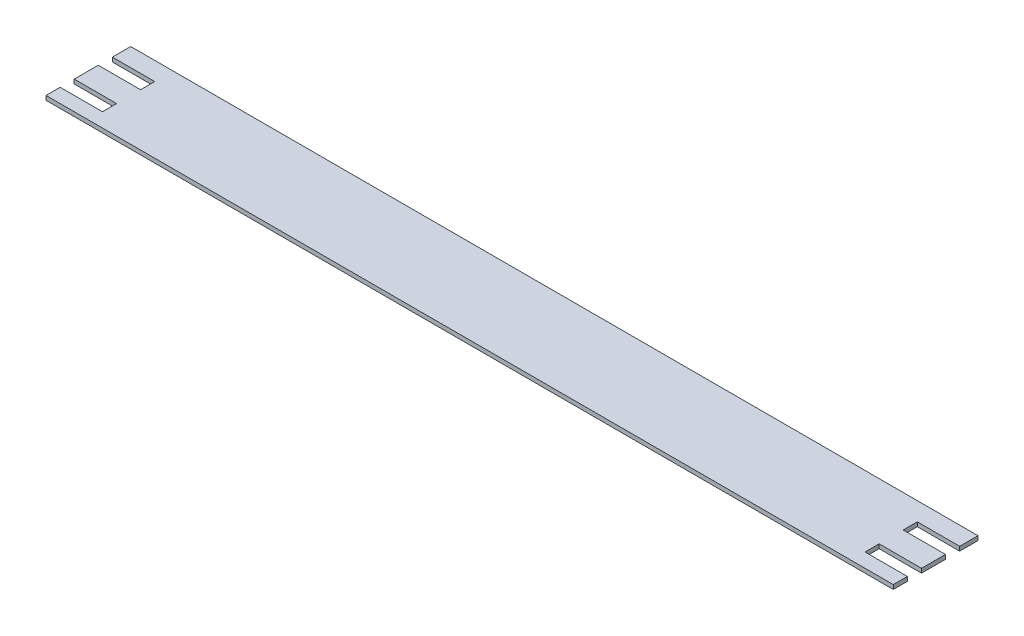
ISO-10303-21;
HEADER;
FILE_DESCRIPTION(('STEP AP214'),'2;1');
FILE_NAME('part.step','',(''),(''),'','','');
FILE_SCHEMA(('AUTOMOTIVE_DESIGN { 1 0 10303 214 1 1 1 1 }'));
ENDSEC;
DATA;
#1=APPLICATION_CONTEXT('core data for automotive mechanical design processes');
#2=APPLICATION_PROTOCOL_DEFINITION('international standard','automotive_design',2000,#1);
#3=PRODUCT_CONTEXT('',#1,'mechanical');
#4=PRODUCT('Part','Part','',(#3));
#5=PRODUCT_RELATED_PRODUCT_CATEGORY('part','',(#4));
#6=PRODUCT_DEFINITION_FORMATION('','',#4);
#7=PRODUCT_DEFINITION_CONTEXT('part definition',#1,'design');
#8=PRODUCT_DEFINITION('design','',#6,#7);
#9=PRODUCT_DEFINITION_SHAPE('','',#8);
#10=(LENGTH_UNIT() NAMED_UNIT(*) SI_UNIT(.MILLI.,.METRE.));
#11=(NAMED_UNIT(*) PLANE_ANGLE_UNIT() SI_UNIT($,.RADIAN.));
#12=(NAMED_UNIT(*) SI_UNIT($,.STERADIAN.) SOLID_ANGLE_UNIT());
#13=UNCERTAINTY_MEASURE_WITH_UNIT(LENGTH_MEASURE(1.E-05),#10,'distance_accuracy_value','');
#14=(GEOMETRIC_REPRESENTATION_CONTEXT(3) GLOBAL_UNCERTAINTY_ASSIGNED_CONTEXT((#13)) GLOBAL_UNIT_ASSIGNED_CONTEXT((#10,
#11,#12)) REPRESENTATION_CONTEXT('',''));
#15=CARTESIAN_POINT('',(0.,0.,0.));
#16=DIRECTION('',(0.,0.,1.));
#17=DIRECTION('',(1.,0.,0.));
#18=AXIS2_PLACEMENT_3D('',#15,#16,#17);
#19=CARTESIAN_POINT('',(300.,-50.01,13.));
#20=DIRECTION('',(0.,0.,-1.));
#21=DIRECTION('',(-1.,0.,0.));
#22=AXIS2_PLACEMENT_3D('',#19,#20,#21);
#23=PLANE('',#22);
#24=DIRECTION('',(0.,-1.,0.));
#25=VECTOR('',#24,1.);
#26=CARTESIAN_POINT('',(300.,1.71683972880179E-13,13.));
#27=LINE('',#26,#25);
#28=CARTESIAN_POINT('',(300.,-47.,13.));
#29=VERTEX_POINT('',#28);
#30=CARTESIAN_POINT('',(300.,-50.,13.));
#31=VERTEX_POINT('',#30);
#32=EDGE_CURVE('E231',#29,#31,#27,.T.);
#33=ORIENTED_EDGE('',*,*,#32,.F.);
#34=DIRECTION('',(1.,0.,0.));
#35=VECTOR('',#34,1.);
#36=CARTESIAN_POINT('',(-300.,-47.,13.));
#37=LINE('',#36,#35);
#38=CARTESIAN_POINT('',(270.,-47.,13.));
#39=VERTEX_POINT('',#38);
#40=EDGE_CURVE('E240',#39,#29,#37,.T.);
#41=ORIENTED_EDGE('',*,*,#40,.F.);
#42=DIRECTION('',(0.,1.,0.));
#43=VECTOR('',#42,1.);
#44=CARTESIAN_POINT('',(270.,-50.01,13.));
#45=LINE('',#44,#43);
#46=CARTESIAN_POINT('',(270.,-50.,13.));
#47=VERTEX_POINT('',#46);
#48=EDGE_CURVE('E303',#47,#39,#45,.T.);
#49=ORIENTED_EDGE('',*,*,#48,.F.);
#50=DIRECTION('',(-1.,0.,0.));
#51=VECTOR('',#50,1.);
#52=CARTESIAN_POINT('',(-300.,-50.,13.));
#53=LINE('',#52,#51);
#54=EDGE_CURVE('E268',#31,#47,#53,.T.);
#55=ORIENTED_EDGE('',*,*,#54,.F.);
#56=EDGE_LOOP('',(#33,#41,#49,#55));
#57=FACE_BOUND('',#56,.T.);
#58=ADVANCED_FACE('F35',(#57),#23,.F.);
#59=CARTESIAN_POINT('',(300.,-50.01,23.));
#60=DIRECTION('',(0.,0.,1.));
#61=DIRECTION('',(1.,0.,0.));
#62=AXIS2_PLACEMENT_3D('',#59,#60,#61);
#63=PLANE('',#62);
#64=DIRECTION('',(0.,1.,0.));
#65=VECTOR('',#64,1.);
#66=CARTESIAN_POINT('',(270.,-50.01,23.));
#67=LINE('',#66,#65);
#68=CARTESIAN_POINT('',(270.,-50.,23.));
#69=VERTEX_POINT('',#68);
#70=CARTESIAN_POINT('',(270.,-47.,23.));
#71=VERTEX_POINT('',#70);
#72=EDGE_CURVE('E39',#69,#71,#67,.T.);
#73=ORIENTED_EDGE('',*,*,#72,.T.);
#74=DIRECTION('',(-1.,0.,0.));
#75=VECTOR('',#74,1.);
#76=CARTESIAN_POINT('',(-300.,-47.,23.));
#77=LINE('',#76,#75);
#78=CARTESIAN_POINT('',(300.,-47.,23.));
#79=VERTEX_POINT('',#78);
#80=EDGE_CURVE('E280',#79,#71,#77,.T.);
#81=ORIENTED_EDGE('',*,*,#80,.F.);
#82=DIRECTION('',(0.,1.,0.));
#83=VECTOR('',#82,1.);
#84=CARTESIAN_POINT('',(300.,1.71683972880179E-13,23.));
#85=LINE('',#84,#83);
#86=CARTESIAN_POINT('',(300.,-50.,23.));
#87=VERTEX_POINT('',#86);
#88=EDGE_CURVE('E228',#87,#79,#85,.T.);
#89=ORIENTED_EDGE('',*,*,#88,.F.);
#90=DIRECTION('',(1.,0.,0.));
#91=VECTOR('',#90,1.);
#92=CARTESIAN_POINT('',(-300.,-50.,23.));
#93=LINE('',#92,#91);
#94=EDGE_CURVE('E272',#69,#87,#93,.T.);
#95=ORIENTED_EDGE('',*,*,#94,.F.);
#96=EDGE_LOOP('',(#73,#81,#89,#95));
#97=FACE_BOUND('',#96,.T.);
#98=ADVANCED_FACE('F316',(#97),#63,.F.);
#99=CARTESIAN_POINT('',(270.,-50.01,13.));
#100=DIRECTION('',(-1.,0.,0.));
#101=DIRECTION('',(0.,0.,1.));
#102=AXIS2_PLACEMENT_3D('',#99,#100,#101);
#103=PLANE('',#102);
#104=ORIENTED_EDGE('',*,*,#48,.T.);
#105=DIRECTION('',(0.,0.,-1.));
#106=VECTOR('',#105,1.);
#107=CARTESIAN_POINT('',(270.,-47.,3.));
#108=LINE('',#107,#106);
#109=EDGE_CURVE('E320',#71,#39,#108,.T.);
#110=ORIENTED_EDGE('',*,*,#109,.F.);
#111=ORIENTED_EDGE('',*,*,#72,.F.);
#112=DIRECTION('',(0.,0.,1.));
#113=VECTOR('',#112,1.);
#114=CARTESIAN_POINT('',(270.,-50.,60.));
#115=LINE('',#114,#113);
#116=EDGE_CURVE('E345',#47,#69,#115,.T.);
#117=ORIENTED_EDGE('',*,*,#116,.F.);
#118=EDGE_LOOP('',(#104,#110,#111,#117));
#119=FACE_BOUND('',#118,.T.);
#120=ADVANCED_FACE('F321',(#119),#103,.F.);
#121=CARTESIAN_POINT('',(300.,-50.01,40.));
#122=DIRECTION('',(0.,0.,-1.));
#123=DIRECTION('',(-1.,0.,0.));
#124=AXIS2_PLACEMENT_3D('',#121,#122,#123);
#125=PLANE('',#124);
#126=DIRECTION('',(0.,-1.,0.));
#127=VECTOR('',#126,1.);
#128=CARTESIAN_POINT('',(300.,1.71683972880179E-13,40.));
#129=LINE('',#128,#127);
#130=CARTESIAN_POINT('',(300.,-47.,40.));
#131=VERTEX_POINT('',#130);
#132=CARTESIAN_POINT('',(300.,-50.,40.));
#133=VERTEX_POINT('',#132);
#134=EDGE_CURVE('E225',#131,#133,#129,.T.);
#135=ORIENTED_EDGE('',*,*,#134,.F.);
#136=DIRECTION('',(1.,0.,0.));
#137=VECTOR('',#136,1.);
#138=CARTESIAN_POINT('',(-300.,-47.,40.));
#139=LINE('',#138,#137);
#140=CARTESIAN_POINT('',(270.,-47.,40.));
#141=VERTEX_POINT('',#140);
#142=EDGE_CURVE('E235',#141,#131,#139,.T.);
#143=ORIENTED_EDGE('',*,*,#142,.F.);
#144=DIRECTION('',(0.,1.,0.));
#145=VECTOR('',#144,1.);
#146=CARTESIAN_POINT('',(270.,-50.01,40.));
#147=LINE('',#146,#145);
#148=CARTESIAN_POINT('',(270.,-50.,40.));
#149=VERTEX_POINT('',#148);
#150=EDGE_CURVE('E254',#149,#141,#147,.T.);
#151=ORIENTED_EDGE('',*,*,#150,.F.);
#152=DIRECTION('',(-1.,0.,0.));
#153=VECTOR('',#152,1.);
#154=CARTESIAN_POINT('',(-300.,-50.,40.));
#155=LINE('',#154,#153);
#156=EDGE_CURVE('E244',#133,#149,#155,.T.);
#157=ORIENTED_EDGE('',*,*,#156,.F.);
#158=EDGE_LOOP('',(#135,#143,#151,#157));
#159=FACE_BOUND('',#158,.T.);
#160=ADVANCED_FACE('F377',(#159),#125,.F.);
#161=CARTESIAN_POINT('',(300.,-50.01,50.));
#162=DIRECTION('',(0.,0.,1.));
#163=DIRECTION('',(1.,0.,0.));
#164=AXIS2_PLACEMENT_3D('',#161,#162,#163);
#165=PLANE('',#164);
#166=DIRECTION('',(0.,1.,0.));
#167=VECTOR('',#166,1.);
#168=CARTESIAN_POINT('',(270.,-50.01,50.));
#169=LINE('',#168,#167);
#170=CARTESIAN_POINT('',(270.,-50.,50.));
#171=VERTEX_POINT('',#170);
#172=CARTESIAN_POINT('',(270.,-47.,50.));
#173=VERTEX_POINT('',#172);
#174=EDGE_CURVE('E258',#171,#173,#169,.T.);
#175=ORIENTED_EDGE('',*,*,#174,.T.);
#176=DIRECTION('',(-1.,0.,0.));
#177=VECTOR('',#176,1.);
#178=CARTESIAN_POINT('',(-300.,-47.,50.));
#179=LINE('',#178,#177);
#180=CARTESIAN_POINT('',(300.,-47.,50.));
#181=VERTEX_POINT('',#180);
#182=EDGE_CURVE('E229',#181,#173,#179,.T.);
#183=ORIENTED_EDGE('',*,*,#182,.F.);
#184=DIRECTION('',(0.,1.,0.));
#185=VECTOR('',#184,1.);
#186=CARTESIAN_POINT('',(300.,1.71683972880179E-13,50.));
#187=LINE('',#186,#185);
#188=CARTESIAN_POINT('',(300.,-50.,50.));
#189=VERTEX_POINT('',#188);
#190=EDGE_CURVE('E223',#189,#181,#187,.T.);
#191=ORIENTED_EDGE('',*,*,#190,.F.);
#192=DIRECTION('',(1.,0.,0.));
#193=VECTOR('',#192,1.);
#194=CARTESIAN_POINT('',(-300.,-50.,50.));
#195=LINE('',#194,#193);
#196=EDGE_CURVE('E238',#171,#189,#195,.T.);
#197=ORIENTED_EDGE('',*,*,#196,.F.);
#198=EDGE_LOOP('',(#175,#183,#191,#197));
#199=FACE_BOUND('',#198,.T.);
#200=ADVANCED_FACE('F381',(#199),#165,.F.);
#201=CARTESIAN_POINT('',(270.,-50.01,40.));
#202=DIRECTION('',(-1.,0.,0.));
#203=DIRECTION('',(0.,0.,1.));
#204=AXIS2_PLACEMENT_3D('',#201,#202,#203);
#205=PLANE('',#204);
#206=ORIENTED_EDGE('',*,*,#150,.T.);
#207=DIRECTION('',(0.,0.,-1.));
#208=VECTOR('',#207,1.);
#209=CARTESIAN_POINT('',(270.,-47.,3.));
#210=LINE('',#209,#208);
#211=EDGE_CURVE('E232',#173,#141,#210,.T.);
#212=ORIENTED_EDGE('',*,*,#211,.F.);
#213=ORIENTED_EDGE('',*,*,#174,.F.);
#214=DIRECTION('',(0.,0.,1.));
#215=VECTOR('',#214,1.);
#216=CARTESIAN_POINT('',(270.,-50.,60.));
#217=LINE('',#216,#215);
#218=EDGE_CURVE('E241',#149,#171,#217,.T.);
#219=ORIENTED_EDGE('',*,*,#218,.F.);
#220=EDGE_LOOP('',(#206,#212,#213,#219));
#221=FACE_BOUND('',#220,.T.);
#222=ADVANCED_FACE('F387',(#221),#205,.F.);
#223=CARTESIAN_POINT('',(-300.,-50.01,23.));
#224=DIRECTION('',(0.,0.,1.));
#225=DIRECTION('',(1.,0.,0.));
#226=AXIS2_PLACEMENT_3D('',#223,#224,#225);
#227=PLANE('',#226);
#228=DIRECTION('',(0.,1.,0.));
#229=VECTOR('',#228,1.);
#230=CARTESIAN_POINT('',(-300.,0.,23.));
#231=LINE('',#230,#229);
#232=CARTESIAN_POINT('',(-300.,-50.,23.));
#233=VERTEX_POINT('',#232);
#234=CARTESIAN_POINT('',(-300.,-47.,23.));
#235=VERTEX_POINT('',#234);
#236=EDGE_CURVE('E184',#233,#235,#231,.T.);
#237=ORIENTED_EDGE('',*,*,#236,.T.);
#238=DIRECTION('',(-1.,0.,0.));
#239=VECTOR('',#238,1.);
#240=CARTESIAN_POINT('',(-300.,-47.,23.));
#241=LINE('',#240,#239);
#242=CARTESIAN_POINT('',(-270.,-47.,23.));
#243=VERTEX_POINT('',#242);
#244=EDGE_CURVE('E278',#243,#235,#241,.T.);
#245=ORIENTED_EDGE('',*,*,#244,.F.);
#246=DIRECTION('',(0.,1.,0.));
#247=VECTOR('',#246,1.);
#248=CARTESIAN_POINT('',(-270.,-50.01,23.));
#249=LINE('',#248,#247);
#250=CARTESIAN_POINT('',(-270.,-50.,23.));
#251=VERTEX_POINT('',#250);
#252=EDGE_CURVE('E262',#251,#243,#249,.T.);
#253=ORIENTED_EDGE('',*,*,#252,.F.);
#254=DIRECTION('',(1.,0.,0.));
#255=VECTOR('',#254,1.);
#256=CARTESIAN_POINT('',(-300.,-50.,23.));
#257=LINE('',#256,#255);
#258=EDGE_CURVE('E269',#233,#251,#257,.T.);
#259=ORIENTED_EDGE('',*,*,#258,.F.);
#260=EDGE_LOOP('',(#237,#245,#253,#259));
#261=FACE_BOUND('',#260,.T.);
#262=ADVANCED_FACE('F393',(#261),#227,.F.);
#263=CARTESIAN_POINT('',(-300.,-50.01,13.));
#264=DIRECTION('',(0.,0.,-1.));
#265=DIRECTION('',(-1.,0.,0.));
#266=AXIS2_PLACEMENT_3D('',#263,#264,#265);
#267=PLANE('',#266);
#268=DIRECTION('',(0.,1.,0.));
#269=VECTOR('',#268,1.);
#270=CARTESIAN_POINT('',(-270.,-50.01,13.));
#271=LINE('',#270,#269);
#272=CARTESIAN_POINT('',(-270.,-50.,13.));
#273=VERTEX_POINT('',#272);
#274=CARTESIAN_POINT('',(-270.,-47.,13.));
#275=VERTEX_POINT('',#274);
#276=EDGE_CURVE('E191',#273,#275,#271,.T.);
#277=ORIENTED_EDGE('',*,*,#276,.T.);
#278=DIRECTION('',(1.,0.,0.));
#279=VECTOR('',#278,1.);
#280=CARTESIAN_POINT('',(-300.,-47.,13.));
#281=LINE('',#280,#279);
#282=CARTESIAN_POINT('',(-300.,-47.,13.));
#283=VERTEX_POINT('',#282);
#284=EDGE_CURVE('E188',#283,#275,#281,.T.);
#285=ORIENTED_EDGE('',*,*,#284,.F.);
#286=DIRECTION('',(0.,-1.,0.));
#287=VECTOR('',#286,1.);
#288=CARTESIAN_POINT('',(-300.,0.,13.));
#289=LINE('',#288,#287);
#290=CARTESIAN_POINT('',(-300.,-50.,13.));
#291=VERTEX_POINT('',#290);
#292=EDGE_CURVE('E176',#283,#291,#289,.T.);
#293=ORIENTED_EDGE('',*,*,#292,.T.);
#294=DIRECTION('',(-1.,0.,0.));
#295=VECTOR('',#294,1.);
#296=CARTESIAN_POINT('',(-300.,-50.,13.));
#297=LINE('',#296,#295);
#298=EDGE_CURVE('E275',#273,#291,#297,.T.);
#299=ORIENTED_EDGE('',*,*,#298,.F.);
#300=EDGE_LOOP('',(#277,#285,#293,#299));
#301=FACE_BOUND('',#300,.T.);
#302=ADVANCED_FACE('F189',(#301),#267,.F.);
#303=CARTESIAN_POINT('',(-270.,-50.01,13.));
#304=DIRECTION('',(1.,0.,0.));
#305=DIRECTION('',(0.,0.,-1.));
#306=AXIS2_PLACEMENT_3D('',#303,#304,#305);
#307=PLANE('',#306);
#308=ORIENTED_EDGE('',*,*,#252,.T.);
#309=DIRECTION('',(0.,0.,1.));
#310=VECTOR('',#309,1.);
#311=CARTESIAN_POINT('',(-270.,-47.,3.));
#312=LINE('',#311,#310);
#313=EDGE_CURVE('E195',#275,#243,#312,.T.);
#314=ORIENTED_EDGE('',*,*,#313,.F.);
#315=ORIENTED_EDGE('',*,*,#276,.F.);
#316=DIRECTION('',(0.,0.,-1.));
#317=VECTOR('',#316,1.);
#318=CARTESIAN_POINT('',(-270.,-50.,60.));
#319=LINE('',#318,#317);
#320=EDGE_CURVE('E271',#251,#273,#319,.T.);
#321=ORIENTED_EDGE('',*,*,#320,.F.);
#322=EDGE_LOOP('',(#308,#314,#315,#321));
#323=FACE_BOUND('',#322,.T.);
#324=ADVANCED_FACE('F403',(#323),#307,.F.);
#325=CARTESIAN_POINT('',(-300.,-50.01,50.));
#326=DIRECTION('',(0.,0.,1.));
#327=DIRECTION('',(1.,0.,0.));
#328=AXIS2_PLACEMENT_3D('',#325,#326,#327);
#329=PLANE('',#328);
#330=DIRECTION('',(0.,1.,0.));
#331=VECTOR('',#330,1.);
#332=CARTESIAN_POINT('',(-300.,0.,50.));
#333=LINE('',#332,#331);
#334=CARTESIAN_POINT('',(-300.,-50.,50.));
#335=VERTEX_POINT('',#334);
#336=CARTESIAN_POINT('',(-300.,-47.,50.));
#337=VERTEX_POINT('',#336);
#338=EDGE_CURVE('E185',#335,#337,#333,.T.);
#339=ORIENTED_EDGE('',*,*,#338,.T.);
#340=DIRECTION('',(-1.,0.,0.));
#341=VECTOR('',#340,1.);
#342=CARTESIAN_POINT('',(-300.,-47.,50.));
#343=LINE('',#342,#341);
#344=CARTESIAN_POINT('',(-270.,-47.,50.));
#345=VERTEX_POINT('',#344);
#346=EDGE_CURVE('E194',#345,#337,#343,.T.);
#347=ORIENTED_EDGE('',*,*,#346,.F.);
#348=DIRECTION('',(0.,1.,0.));
#349=VECTOR('',#348,1.);
#350=CARTESIAN_POINT('',(-270.,-50.01,50.));
#351=LINE('',#350,#349);
#352=CARTESIAN_POINT('',(-270.,-50.,50.));
#353=VERTEX_POINT('',#352);
#354=EDGE_CURVE('E263',#353,#345,#351,.T.);
#355=ORIENTED_EDGE('',*,*,#354,.F.);
#356=DIRECTION('',(1.,0.,0.));
#357=VECTOR('',#356,1.);
#358=CARTESIAN_POINT('',(-300.,-50.,50.));
#359=LINE('',#358,#357);
#360=EDGE_CURVE('E277',#335,#353,#359,.T.);
#361=ORIENTED_EDGE('',*,*,#360,.F.);
#362=EDGE_LOOP('',(#339,#347,#355,#361));
#363=FACE_BOUND('',#362,.T.);
#364=ADVANCED_FACE('F296',(#363),#329,.F.);
#365=CARTESIAN_POINT('',(-300.,-50.01,40.));
#366=DIRECTION('',(0.,0.,-1.));
#367=DIRECTION('',(-1.,0.,0.));
#368=AXIS2_PLACEMENT_3D('',#365,#366,#367);
#369=PLANE('',#368);
#370=DIRECTION('',(0.,1.,0.));
#371=VECTOR('',#370,1.);
#372=CARTESIAN_POINT('',(-270.,-50.01,40.));
#373=LINE('',#372,#371);
#374=CARTESIAN_POINT('',(-270.,-50.,40.));
#375=VERTEX_POINT('',#374);
#376=CARTESIAN_POINT('',(-270.,-47.,40.));
#377=VERTEX_POINT('',#376);
#378=EDGE_CURVE('E257',#375,#377,#373,.T.);
#379=ORIENTED_EDGE('',*,*,#378,.T.);
#380=DIRECTION('',(1.,0.,0.));
#381=VECTOR('',#380,1.);
#382=CARTESIAN_POINT('',(-300.,-47.,40.));
#383=LINE('',#382,#381);
#384=CARTESIAN_POINT('',(-300.,-47.,40.));
#385=VERTEX_POINT('',#384);
#386=EDGE_CURVE('E237',#385,#377,#383,.T.);
#387=ORIENTED_EDGE('',*,*,#386,.F.);
#388=DIRECTION('',(0.,-1.,0.));
#389=VECTOR('',#388,1.);
#390=CARTESIAN_POINT('',(-300.,0.,40.));
#391=LINE('',#390,#389);
#392=CARTESIAN_POINT('',(-300.,-50.,40.));
#393=VERTEX_POINT('',#392);
#394=EDGE_CURVE('E305',#385,#393,#391,.T.);
#395=ORIENTED_EDGE('',*,*,#394,.T.);
#396=DIRECTION('',(-1.,0.,0.));
#397=VECTOR('',#396,1.);
#398=CARTESIAN_POINT('',(-300.,-50.,40.));
#399=LINE('',#398,#397);
#400=EDGE_CURVE('E246',#375,#393,#399,.T.);
#401=ORIENTED_EDGE('',*,*,#400,.F.);
#402=EDGE_LOOP('',(#379,#387,#395,#401));
#403=FACE_BOUND('',#402,.T.);
#404=ADVANCED_FACE('F409',(#403),#369,.F.);
#405=CARTESIAN_POINT('',(-270.,-50.01,40.));
#406=DIRECTION('',(1.,0.,0.));
#407=DIRECTION('',(0.,0.,-1.));
#408=AXIS2_PLACEMENT_3D('',#405,#406,#407);
#409=PLANE('',#408);
#410=ORIENTED_EDGE('',*,*,#354,.T.);
#411=DIRECTION('',(0.,0.,1.));
#412=VECTOR('',#411,1.);
#413=CARTESIAN_POINT('',(-270.,-47.,3.));
#414=LINE('',#413,#412);
#415=EDGE_CURVE('E291',#377,#345,#414,.T.);
#416=ORIENTED_EDGE('',*,*,#415,.F.);
#417=ORIENTED_EDGE('',*,*,#378,.F.);
#418=DIRECTION('',(0.,0.,-1.));
#419=VECTOR('',#418,1.);
#420=CARTESIAN_POINT('',(-270.,-50.,60.));
#421=LINE('',#420,#419);
#422=EDGE_CURVE('E293',#353,#375,#421,.T.);
#423=ORIENTED_EDGE('',*,*,#422,.F.);
#424=EDGE_LOOP('',(#410,#416,#417,#423));
#425=FACE_BOUND('',#424,.T.);
#426=ADVANCED_FACE('F288',(#425),#409,.F.);
#427=CARTESIAN_POINT('',(-300.,0.,0.));
#428=DIRECTION('',(0.,0.,1.));
#429=DIRECTION('',(1.,0.,0.));
#430=AXIS2_PLACEMENT_3D('',#427,#428,#429);
#431=PLANE('',#430);
#432=DIRECTION('',(0.,-1.,0.));
#433=VECTOR('',#432,1.);
#434=CARTESIAN_POINT('',(-300.,0.,0.));
#435=LINE('',#434,#433);
#436=CARTESIAN_POINT('',(-300.,-47.,0.));
#437=VERTEX_POINT('',#436);
#438=CARTESIAN_POINT('',(-300.,-50.,0.));
#439=VERTEX_POINT('',#438);
#440=EDGE_CURVE('E11',#437,#439,#435,.T.);
#441=ORIENTED_EDGE('',*,*,#440,.F.);
#442=DIRECTION('',(-1.,0.,0.));
#443=VECTOR('',#442,1.);
#444=CARTESIAN_POINT('',(-300.,-47.,0.));
#445=LINE('',#444,#443);
#446=CARTESIAN_POINT('',(300.,-47.,0.));
#447=VERTEX_POINT('',#446);
#448=EDGE_CURVE('E199',#447,#437,#445,.T.);
#449=ORIENTED_EDGE('',*,*,#448,.F.);
#450=DIRECTION('',(0.,-1.,0.));
#451=VECTOR('',#450,1.);
#452=CARTESIAN_POINT('',(300.,3.43367945760358E-13,0.));
#453=LINE('',#452,#451);
#454=CARTESIAN_POINT('',(300.,-50.,0.));
#455=VERTEX_POINT('',#454);
#456=EDGE_CURVE('E44',#447,#455,#453,.T.);
#457=ORIENTED_EDGE('',*,*,#456,.T.);
#458=DIRECTION('',(1.,0.,0.));
#459=VECTOR('',#458,1.);
#460=CARTESIAN_POINT('',(-300.,-50.,0.));
#461=LINE('',#460,#459);
#462=EDGE_CURVE('E213',#439,#455,#461,.T.);
#463=ORIENTED_EDGE('',*,*,#462,.F.);
#464=EDGE_LOOP('',(#441,#449,#457,#463));
#465=FACE_BOUND('',#464,.T.);
#466=ADVANCED_FACE('F353',(#465),#431,.F.);
#467=CARTESIAN_POINT('',(-300.,0.,60.));
#468=DIRECTION('',(0.,0.,1.));
#469=DIRECTION('',(1.,0.,0.));
#470=AXIS2_PLACEMENT_3D('',#467,#468,#469);
#471=PLANE('',#470);
#472=DIRECTION('',(1.,0.,0.));
#473=VECTOR('',#472,1.);
#474=CARTESIAN_POINT('',(-300.,-47.,60.));
#475=LINE('',#474,#473);
#476=CARTESIAN_POINT('',(-300.,-47.,60.));
#477=VERTEX_POINT('',#476);
#478=CARTESIAN_POINT('',(300.,-47.,60.));
#479=VERTEX_POINT('',#478);
#480=EDGE_CURVE('E209',#477,#479,#475,.T.);
#481=ORIENTED_EDGE('',*,*,#480,.F.);
#482=DIRECTION('',(0.,-1.,0.));
#483=VECTOR('',#482,1.);
#484=CARTESIAN_POINT('',(-300.,0.,60.));
#485=LINE('',#484,#483);
#486=CARTESIAN_POINT('',(-300.,-50.,60.));
#487=VERTEX_POINT('',#486);
#488=EDGE_CURVE('E329',#477,#487,#485,.T.);
#489=ORIENTED_EDGE('',*,*,#488,.T.);
#490=DIRECTION('',(1.,0.,0.));
#491=VECTOR('',#490,1.);
#492=CARTESIAN_POINT('',(-300.,-50.,60.));
#493=LINE('',#492,#491);
#494=CARTESIAN_POINT('',(300.,-50.,60.));
#495=VERTEX_POINT('',#494);
#496=EDGE_CURVE('E201',#487,#495,#493,.T.);
#497=ORIENTED_EDGE('',*,*,#496,.T.);
#498=DIRECTION('',(0.,-1.,0.));
#499=VECTOR('',#498,1.);
#500=CARTESIAN_POINT('',(300.,3.43367945760358E-13,60.));
#501=LINE('',#500,#499);
#502=EDGE_CURVE('E332',#479,#495,#501,.T.);
#503=ORIENTED_EDGE('',*,*,#502,.F.);
#504=EDGE_LOOP('',(#481,#489,#497,#503));
#505=FACE_BOUND('',#504,.T.);
#506=ADVANCED_FACE('F361',(#505),#471,.T.);
#507=CARTESIAN_POINT('',(-300.,-47.,3.));
#508=DIRECTION('',(0.,-1.,0.));
#509=DIRECTION('',(0.,0.,-1.));
#510=AXIS2_PLACEMENT_3D('',#507,#508,#509);
#511=PLANE('',#510);
#512=ORIENTED_EDGE('',*,*,#109,.T.);
#513=ORIENTED_EDGE('',*,*,#40,.T.);
#514=DIRECTION('',(0.,0.,1.));
#515=VECTOR('',#514,1.);
#516=CARTESIAN_POINT('',(300.,-47.,3.));
#517=LINE('',#516,#515);
#518=EDGE_CURVE('E60',#447,#29,#517,.T.);
#519=ORIENTED_EDGE('',*,*,#518,.F.);
#520=ORIENTED_EDGE('',*,*,#448,.T.);
#521=DIRECTION('',(0.,0.,1.));
#522=VECTOR('',#521,1.);
#523=CARTESIAN_POINT('',(-300.,-47.,3.));
#524=LINE('',#523,#522);
#525=EDGE_CURVE('E180',#437,#283,#524,.T.);
#526=ORIENTED_EDGE('',*,*,#525,.T.);
#527=ORIENTED_EDGE('',*,*,#284,.T.);
#528=ORIENTED_EDGE('',*,*,#313,.T.);
#529=ORIENTED_EDGE('',*,*,#244,.T.);
#530=EDGE_CURVE('E200',#235,#385,#524,.T.);
#531=ORIENTED_EDGE('',*,*,#530,.T.);
#532=ORIENTED_EDGE('',*,*,#386,.T.);
#533=ORIENTED_EDGE('',*,*,#415,.T.);
#534=ORIENTED_EDGE('',*,*,#346,.T.);
#535=EDGE_CURVE('E203',#337,#477,#524,.T.);
#536=ORIENTED_EDGE('',*,*,#535,.T.);
#537=ORIENTED_EDGE('',*,*,#480,.T.);
#538=EDGE_CURVE('E249',#181,#479,#517,.T.);
#539=ORIENTED_EDGE('',*,*,#538,.F.);
#540=ORIENTED_EDGE('',*,*,#182,.T.);
#541=ORIENTED_EDGE('',*,*,#211,.T.);
#542=ORIENTED_EDGE('',*,*,#142,.T.);
#543=EDGE_CURVE('E248',#79,#131,#517,.T.);
#544=ORIENTED_EDGE('',*,*,#543,.F.);
#545=ORIENTED_EDGE('',*,*,#80,.T.);
#546=EDGE_LOOP('',(#512,#513,#519,#520,#526,#527,#528,#529,#531,#532,#533,#534,#536,#537,#539,
#540,#541,#542,#544,#545));
#547=FACE_BOUND('',#546,.T.);
#548=ADVANCED_FACE('F37',(#547),#511,.F.);
#549=CARTESIAN_POINT('',(-300.,-50.,60.));
#550=DIRECTION('',(0.,1.,0.));
#551=DIRECTION('',(0.,0.,1.));
#552=AXIS2_PLACEMENT_3D('',#549,#550,#551);
#553=PLANE('',#552);
#554=DIRECTION('',(0.,0.,-1.));
#555=VECTOR('',#554,1.);
#556=CARTESIAN_POINT('',(300.,-50.,60.));
#557=LINE('',#556,#555);
#558=EDGE_CURVE('E52',#31,#455,#557,.T.);
#559=ORIENTED_EDGE('',*,*,#558,.F.);
#560=ORIENTED_EDGE('',*,*,#54,.T.);
#561=ORIENTED_EDGE('',*,*,#116,.T.);
#562=ORIENTED_EDGE('',*,*,#94,.T.);
#563=EDGE_CURVE('E253',#133,#87,#557,.T.);
#564=ORIENTED_EDGE('',*,*,#563,.F.);
#565=ORIENTED_EDGE('',*,*,#156,.T.);
#566=ORIENTED_EDGE('',*,*,#218,.T.);
#567=ORIENTED_EDGE('',*,*,#196,.T.);
#568=EDGE_CURVE('E250',#495,#189,#557,.T.);
#569=ORIENTED_EDGE('',*,*,#568,.F.);
#570=ORIENTED_EDGE('',*,*,#496,.F.);
#571=DIRECTION('',(0.,0.,-1.));
#572=VECTOR('',#571,1.);
#573=CARTESIAN_POINT('',(-300.,-50.,60.));
#574=LINE('',#573,#572);
#575=EDGE_CURVE('E331',#487,#335,#574,.T.);
#576=ORIENTED_EDGE('',*,*,#575,.T.);
#577=ORIENTED_EDGE('',*,*,#360,.T.);
#578=ORIENTED_EDGE('',*,*,#422,.T.);
#579=ORIENTED_EDGE('',*,*,#400,.T.);
#580=EDGE_CURVE('E354',#393,#233,#574,.T.);
#581=ORIENTED_EDGE('',*,*,#580,.T.);
#582=ORIENTED_EDGE('',*,*,#258,.T.);
#583=ORIENTED_EDGE('',*,*,#320,.T.);
#584=ORIENTED_EDGE('',*,*,#298,.T.);
#585=EDGE_CURVE('E182',#291,#439,#574,.T.);
#586=ORIENTED_EDGE('',*,*,#585,.T.);
#587=ORIENTED_EDGE('',*,*,#462,.T.);
#588=EDGE_LOOP('',(#559,#560,#561,#562,#564,#565,#566,#567,#569,#570,#576,#577,#578,#579,#581,
#582,#583,#584,#586,#587));
#589=FACE_BOUND('',#588,.T.);
#590=ADVANCED_FACE('F343',(#589),#553,.F.);
#591=CARTESIAN_POINT('',(-300.,0.,0.));
#592=DIRECTION('',(-1.,0.,0.));
#593=DIRECTION('',(0.,0.,1.));
#594=AXIS2_PLACEMENT_3D('',#591,#592,#593);
#595=PLANE('',#594);
#596=ORIENTED_EDGE('',*,*,#236,.F.);
#597=ORIENTED_EDGE('',*,*,#580,.F.);
#598=ORIENTED_EDGE('',*,*,#394,.F.);
#599=ORIENTED_EDGE('',*,*,#530,.F.);
#600=EDGE_LOOP('',(#596,#597,#598,#599));
#601=FACE_BOUND('',#600,.T.);
#602=ADVANCED_FACE('F416',(#601),#595,.T.);
#603=ORIENTED_EDGE('',*,*,#338,.F.);
#604=ORIENTED_EDGE('',*,*,#575,.F.);
#605=ORIENTED_EDGE('',*,*,#488,.F.);
#606=ORIENTED_EDGE('',*,*,#535,.F.);
#607=EDGE_LOOP('',(#603,#604,#605,#606));
#608=FACE_BOUND('',#607,.T.);
#609=ADVANCED_FACE('F359',(#608),#595,.T.);
#610=ORIENTED_EDGE('',*,*,#292,.F.);
#611=ORIENTED_EDGE('',*,*,#525,.F.);
#612=ORIENTED_EDGE('',*,*,#440,.T.);
#613=ORIENTED_EDGE('',*,*,#585,.F.);
#614=EDGE_LOOP('',(#610,#611,#612,#613));
#615=FACE_BOUND('',#614,.T.);
#616=ADVANCED_FACE('F178',(#615),#595,.T.);
#617=CARTESIAN_POINT('',(300.,1.71683972880179E-13,0.));
#618=DIRECTION('',(-1.,0.,0.));
#619=DIRECTION('',(0.,-1.,0.));
#620=AXIS2_PLACEMENT_3D('',#617,#618,#619);
#621=PLANE('',#620);
#622=ORIENTED_EDGE('',*,*,#568,.T.);
#623=ORIENTED_EDGE('',*,*,#190,.T.);
#624=ORIENTED_EDGE('',*,*,#538,.T.);
#625=ORIENTED_EDGE('',*,*,#502,.T.);
#626=EDGE_LOOP('',(#622,#623,#624,#625));
#627=FACE_BOUND('',#626,.T.);
#628=ADVANCED_FACE('F395',(#627),#621,.F.);
#629=ORIENTED_EDGE('',*,*,#563,.T.);
#630=ORIENTED_EDGE('',*,*,#88,.T.);
#631=ORIENTED_EDGE('',*,*,#543,.T.);
#632=ORIENTED_EDGE('',*,*,#134,.T.);
#633=EDGE_LOOP('',(#629,#630,#631,#632));
#634=FACE_BOUND('',#633,.T.);
#635=ADVANCED_FACE('F339',(#634),#621,.F.);
#636=ORIENTED_EDGE('',*,*,#518,.T.);
#637=ORIENTED_EDGE('',*,*,#32,.T.);
#638=ORIENTED_EDGE('',*,*,#558,.T.);
#639=ORIENTED_EDGE('',*,*,#456,.F.);
#640=EDGE_LOOP('',(#636,#637,#638,#639));
#641=FACE_BOUND('',#640,.T.);
#642=ADVANCED_FACE('F350',(#641),#621,.F.);
#643=CLOSED_SHELL('',(#58,#98,#120,#160,#200,#222,#262,#302,#324,#364,#404,#426,#466,#506,#548,
#590,#602,#609,#616,#628,#635,#642));
#644=MANIFOLD_SOLID_BREP('B2',#643);
#645=ADVANCED_BREP_SHAPE_REPRESENTATION('',(#18,#644),#14);
#646=SHAPE_DEFINITION_REPRESENTATION(#9,#645);
ENDSEC;
END-ISO-10303-21;
